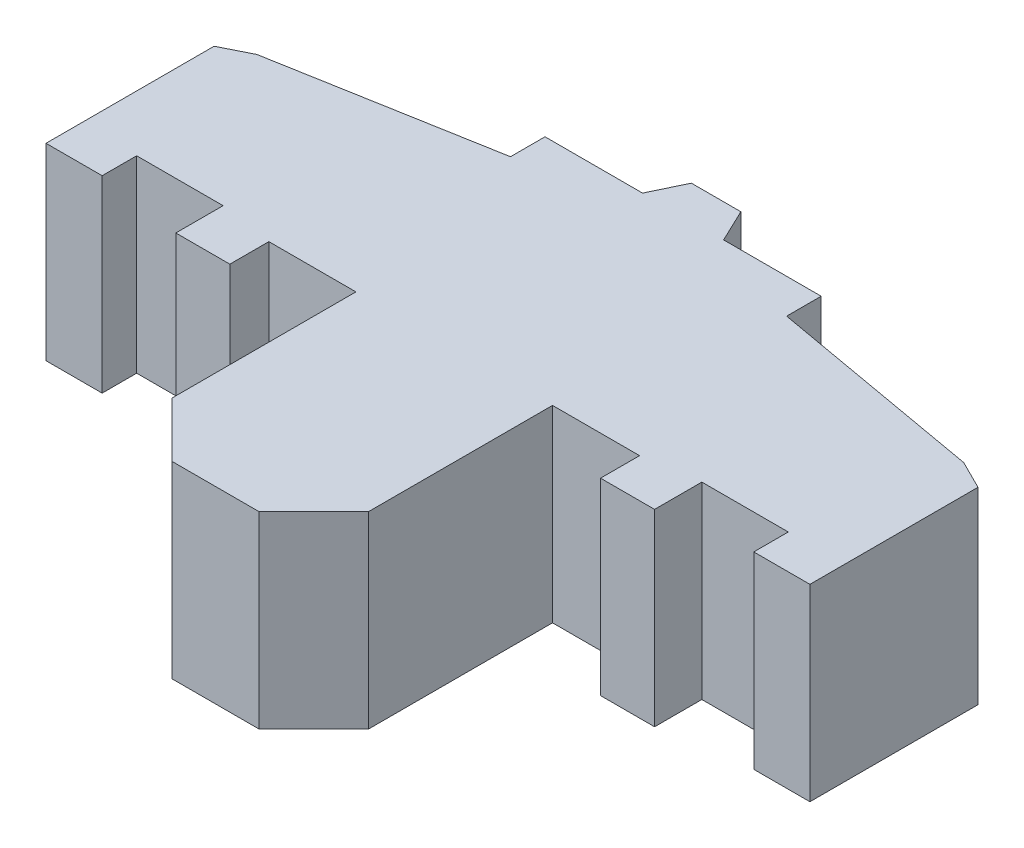
ISO-10303-21;
HEADER;
FILE_DESCRIPTION(('STEP AP214'),'2;1');
FILE_NAME('part.step','',(''),(''),'','','');
FILE_SCHEMA(('AUTOMOTIVE_DESIGN { 1 0 10303 214 1 1 1 1 }'));
ENDSEC;
DATA;
#1=APPLICATION_CONTEXT('core data for automotive mechanical design processes');
#2=APPLICATION_PROTOCOL_DEFINITION('international standard','automotive_design',2000,#1);
#3=PRODUCT_CONTEXT('',#1,'mechanical');
#4=PRODUCT('Part','Part','',(#3));
#5=PRODUCT_RELATED_PRODUCT_CATEGORY('part','',(#4));
#6=PRODUCT_DEFINITION_FORMATION('','',#4);
#7=PRODUCT_DEFINITION_CONTEXT('part definition',#1,'design');
#8=PRODUCT_DEFINITION('design','',#6,#7);
#9=PRODUCT_DEFINITION_SHAPE('','',#8);
#10=(LENGTH_UNIT() NAMED_UNIT(*) SI_UNIT(.MILLI.,.METRE.));
#11=(NAMED_UNIT(*) PLANE_ANGLE_UNIT() SI_UNIT($,.RADIAN.));
#12=(NAMED_UNIT(*) SI_UNIT($,.STERADIAN.) SOLID_ANGLE_UNIT());
#13=UNCERTAINTY_MEASURE_WITH_UNIT(LENGTH_MEASURE(1.E-05),#10,'distance_accuracy_value','');
#14=(GEOMETRIC_REPRESENTATION_CONTEXT(3) GLOBAL_UNCERTAINTY_ASSIGNED_CONTEXT((#13)) GLOBAL_UNIT_ASSIGNED_CONTEXT((#10,
#11,#12)) REPRESENTATION_CONTEXT('',''));
#15=CARTESIAN_POINT('',(0.,0.,0.));
#16=DIRECTION('',(0.,0.,1.));
#17=DIRECTION('',(1.,0.,0.));
#18=AXIS2_PLACEMENT_3D('',#15,#16,#17);
#19=CARTESIAN_POINT('',(5.3663365626813,23.,-43.1982400525542));
#20=DIRECTION('',(1.,0.,0.));
#21=DIRECTION('',(0.,0.,-1.));
#22=AXIS2_PLACEMENT_3D('',#19,#20,#21);
#23=PLANE('',#22);
#24=DIRECTION('',(0.,0.,1.));
#25=VECTOR('',#24,1.);
#26=CARTESIAN_POINT('',(5.3663365626813,0.,-43.1982400525542));
#27=LINE('',#26,#25);
#28=CARTESIAN_POINT('',(5.3663365626813,0.,-43.1982400525542));
#29=VERTEX_POINT('',#28);
#30=CARTESIAN_POINT('',(5.3663365626813,0.,-22.6685783082723));
#31=VERTEX_POINT('',#30);
#32=EDGE_CURVE('E273',#29,#31,#27,.T.);
#33=ORIENTED_EDGE('',*,*,#32,.T.);
#34=DIRECTION('',(0.,-1.,0.));
#35=VECTOR('',#34,1.);
#36=CARTESIAN_POINT('',(5.3663365626813,23.,-22.6685783082723));
#37=LINE('',#36,#35);
#38=CARTESIAN_POINT('',(5.3663365626813,23.,-22.6685783082723));
#39=VERTEX_POINT('',#38);
#40=EDGE_CURVE('E11',#39,#31,#37,.T.);
#41=ORIENTED_EDGE('',*,*,#40,.F.);
#42=DIRECTION('',(0.,0.,1.));
#43=VECTOR('',#42,1.);
#44=CARTESIAN_POINT('',(5.3663365626813,23.,-43.1982400525542));
#45=LINE('',#44,#43);
#46=CARTESIAN_POINT('',(5.3663365626813,23.,-43.1982400525542));
#47=VERTEX_POINT('',#46);
#48=EDGE_CURVE('E336',#47,#39,#45,.T.);
#49=ORIENTED_EDGE('',*,*,#48,.F.);
#50=DIRECTION('',(0.,-1.,0.));
#51=VECTOR('',#50,1.);
#52=CARTESIAN_POINT('',(5.3663365626813,23.,-43.1982400525542));
#53=LINE('',#52,#51);
#54=EDGE_CURVE('E269',#47,#29,#53,.T.);
#55=ORIENTED_EDGE('',*,*,#54,.T.);
#56=EDGE_LOOP('',(#33,#41,#49,#55));
#57=FACE_BOUND('',#56,.T.);
#58=ADVANCED_FACE('F33',(#57),#23,.F.);
#59=CARTESIAN_POINT('',(10.2238011718194,23.,-22.6685783082723));
#60=DIRECTION('',(0.,0.,-1.));
#61=DIRECTION('',(-1.,0.,0.));
#62=AXIS2_PLACEMENT_3D('',#59,#60,#61);
#63=PLANE('',#62);
#64=DIRECTION('',(1.,0.,0.));
#65=VECTOR('',#64,1.);
#66=CARTESIAN_POINT('',(10.2238011718194,0.,-22.6685783082723));
#67=LINE('',#66,#65);
#68=CARTESIAN_POINT('',(12.2238011718194,0.,-22.6685783082723));
#69=VERTEX_POINT('',#68);
#70=EDGE_CURVE('E276',#31,#69,#67,.T.);
#71=ORIENTED_EDGE('',*,*,#70,.T.);
#72=DIRECTION('',(0.,-1.,0.));
#73=VECTOR('',#72,1.);
#74=CARTESIAN_POINT('',(12.2238011718194,23.,-22.6685783082723));
#75=LINE('',#74,#73);
#76=CARTESIAN_POINT('',(12.2238011718194,23.,-22.6685783082723));
#77=VERTEX_POINT('',#76);
#78=EDGE_CURVE('E41',#77,#69,#75,.T.);
#79=ORIENTED_EDGE('',*,*,#78,.F.);
#80=DIRECTION('',(1.,0.,0.));
#81=VECTOR('',#80,1.);
#82=CARTESIAN_POINT('',(5.3663365626813,23.,-22.6685783082723));
#83=LINE('',#82,#81);
#84=EDGE_CURVE('E164',#39,#77,#83,.T.);
#85=ORIENTED_EDGE('',*,*,#84,.F.);
#86=ORIENTED_EDGE('',*,*,#40,.T.);
#87=EDGE_LOOP('',(#71,#79,#85,#86));
#88=FACE_BOUND('',#87,.T.);
#89=ADVANCED_FACE('F514',(#88),#63,.F.);
#90=CARTESIAN_POINT('',(12.2238011718194,23.,-22.6685783082723));
#91=DIRECTION('',(-1.,0.,0.));
#92=DIRECTION('',(0.,0.,1.));
#93=AXIS2_PLACEMENT_3D('',#90,#91,#92);
#94=PLANE('',#93);
#95=DIRECTION('',(0.,0.,-1.));
#96=VECTOR('',#95,1.);
#97=CARTESIAN_POINT('',(12.2238011718194,0.,-22.6685783082723));
#98=LINE('',#97,#96);
#99=CARTESIAN_POINT('',(12.2238011718194,0.,-26.8844909879017));
#100=VERTEX_POINT('',#99);
#101=EDGE_CURVE('E278',#69,#100,#98,.T.);
#102=ORIENTED_EDGE('',*,*,#101,.T.);
#103=DIRECTION('',(0.,-1.,0.));
#104=VECTOR('',#103,1.);
#105=CARTESIAN_POINT('',(12.2238011718194,23.,-26.8844909879017));
#106=LINE('',#105,#104);
#107=CARTESIAN_POINT('',(12.2238011718194,23.,-26.8844909879017));
#108=VERTEX_POINT('',#107);
#109=EDGE_CURVE('E415',#108,#100,#106,.T.);
#110=ORIENTED_EDGE('',*,*,#109,.F.);
#111=DIRECTION('',(0.,0.,-1.));
#112=VECTOR('',#111,1.);
#113=CARTESIAN_POINT('',(12.2238011718194,23.,-22.6685783082723));
#114=LINE('',#113,#112);
#115=EDGE_CURVE('E423',#77,#108,#114,.T.);
#116=ORIENTED_EDGE('',*,*,#115,.F.);
#117=ORIENTED_EDGE('',*,*,#78,.T.);
#118=EDGE_LOOP('',(#102,#110,#116,#117));
#119=FACE_BOUND('',#118,.T.);
#120=ADVANCED_FACE('F421',(#119),#94,.F.);
#121=CARTESIAN_POINT('',(12.2238011718194,23.,-26.8844909879017));
#122=DIRECTION('',(0.,0.,-1.));
#123=DIRECTION('',(-1.,0.,0.));
#124=AXIS2_PLACEMENT_3D('',#121,#122,#123);
#125=PLANE('',#124);
#126=DIRECTION('',(1.,0.,0.));
#127=VECTOR('',#126,1.);
#128=CARTESIAN_POINT('',(12.2238011718194,0.,-26.8844909879017));
#129=LINE('',#128,#127);
#130=CARTESIAN_POINT('',(22.7798889350632,0.,-26.8844909879017));
#131=VERTEX_POINT('',#130);
#132=EDGE_CURVE('E280',#100,#131,#129,.T.);
#133=ORIENTED_EDGE('',*,*,#132,.T.);
#134=DIRECTION('',(0.,-1.,0.));
#135=VECTOR('',#134,1.);
#136=CARTESIAN_POINT('',(22.7798889350632,23.,-26.8844909879017));
#137=LINE('',#136,#135);
#138=CARTESIAN_POINT('',(22.7798889350632,23.,-26.8844909879017));
#139=VERTEX_POINT('',#138);
#140=EDGE_CURVE('E412',#139,#131,#137,.T.);
#141=ORIENTED_EDGE('',*,*,#140,.F.);
#142=DIRECTION('',(1.,0.,0.));
#143=VECTOR('',#142,1.);
#144=CARTESIAN_POINT('',(12.2238011718194,23.,-26.8844909879017));
#145=LINE('',#144,#143);
#146=EDGE_CURVE('E441',#108,#139,#145,.T.);
#147=ORIENTED_EDGE('',*,*,#146,.F.);
#148=ORIENTED_EDGE('',*,*,#109,.T.);
#149=EDGE_LOOP('',(#133,#141,#147,#148));
#150=FACE_BOUND('',#149,.T.);
#151=ADVANCED_FACE('F432',(#150),#125,.F.);
#152=CARTESIAN_POINT('',(22.7798889350632,23.,-26.8844909879017));
#153=DIRECTION('',(1.,0.,0.));
#154=DIRECTION('',(0.,0.,-1.));
#155=AXIS2_PLACEMENT_3D('',#152,#153,#154);
#156=PLANE('',#155);
#157=DIRECTION('',(0.,0.,1.));
#158=VECTOR('',#157,1.);
#159=CARTESIAN_POINT('',(22.7798889350632,0.,-26.8844909879017));
#160=LINE('',#159,#158);
#161=CARTESIAN_POINT('',(22.7798889350632,0.,-21.1105236223224));
#162=VERTEX_POINT('',#161);
#163=EDGE_CURVE('E282',#131,#162,#160,.T.);
#164=ORIENTED_EDGE('',*,*,#163,.T.);
#165=DIRECTION('',(0.,-1.,0.));
#166=VECTOR('',#165,1.);
#167=CARTESIAN_POINT('',(22.7798889350632,23.,-21.1105236223224));
#168=LINE('',#167,#166);
#169=CARTESIAN_POINT('',(22.7798889350632,23.,-21.1105236223224));
#170=VERTEX_POINT('',#169);
#171=EDGE_CURVE('E409',#170,#162,#168,.T.);
#172=ORIENTED_EDGE('',*,*,#171,.F.);
#173=DIRECTION('',(0.,0.,1.));
#174=VECTOR('',#173,1.);
#175=CARTESIAN_POINT('',(22.7798889350632,23.,-26.8844909879017));
#176=LINE('',#175,#174);
#177=EDGE_CURVE('E438',#139,#170,#176,.T.);
#178=ORIENTED_EDGE('',*,*,#177,.F.);
#179=ORIENTED_EDGE('',*,*,#140,.T.);
#180=EDGE_LOOP('',(#164,#172,#178,#179));
#181=FACE_BOUND('',#180,.T.);
#182=ADVANCED_FACE('F436',(#181),#156,.F.);
#183=CARTESIAN_POINT('',(22.7798889350632,23.,-21.1105236223224));
#184=DIRECTION('',(0.,0.,-1.));
#185=DIRECTION('',(-1.,0.,0.));
#186=AXIS2_PLACEMENT_3D('',#183,#184,#185);
#187=PLANE('',#186);
#188=DIRECTION('',(1.,0.,0.));
#189=VECTOR('',#188,1.);
#190=CARTESIAN_POINT('',(22.7798889350632,0.,-21.1105236223224));
#191=LINE('',#190,#189);
#192=CARTESIAN_POINT('',(29.3787087814395,0.,-21.1105236223224));
#193=VERTEX_POINT('',#192);
#194=EDGE_CURVE('E284',#162,#193,#191,.T.);
#195=ORIENTED_EDGE('',*,*,#194,.T.);
#196=DIRECTION('',(0.,-1.,0.));
#197=VECTOR('',#196,1.);
#198=CARTESIAN_POINT('',(29.3787087814395,23.,-21.1105236223224));
#199=LINE('',#198,#197);
#200=CARTESIAN_POINT('',(29.3787087814395,23.,-21.1105236223224));
#201=VERTEX_POINT('',#200);
#202=EDGE_CURVE('E406',#201,#193,#199,.T.);
#203=ORIENTED_EDGE('',*,*,#202,.F.);
#204=DIRECTION('',(1.,0.,0.));
#205=VECTOR('',#204,1.);
#206=CARTESIAN_POINT('',(22.7798889350632,23.,-21.1105236223224));
#207=LINE('',#206,#205);
#208=EDGE_CURVE('E440',#170,#201,#207,.T.);
#209=ORIENTED_EDGE('',*,*,#208,.F.);
#210=ORIENTED_EDGE('',*,*,#171,.T.);
#211=EDGE_LOOP('',(#195,#203,#209,#210));
#212=FACE_BOUND('',#211,.T.);
#213=ADVANCED_FACE('F527',(#212),#187,.F.);
#214=CARTESIAN_POINT('',(29.3787087814395,23.,-21.1105236223224));
#215=DIRECTION('',(-1.,0.,0.));
#216=DIRECTION('',(0.,0.,1.));
#217=AXIS2_PLACEMENT_3D('',#214,#215,#216);
#218=PLANE('',#217);
#219=DIRECTION('',(0.,0.,-1.));
#220=VECTOR('',#219,1.);
#221=CARTESIAN_POINT('',(29.3787087814395,0.,-21.1105236223224));
#222=LINE('',#221,#220);
#223=CARTESIAN_POINT('',(29.3787087814395,0.,-25.8763379558164));
#224=VERTEX_POINT('',#223);
#225=EDGE_CURVE('E286',#193,#224,#222,.T.);
#226=ORIENTED_EDGE('',*,*,#225,.T.);
#227=DIRECTION('',(0.,-1.,0.));
#228=VECTOR('',#227,1.);
#229=CARTESIAN_POINT('',(29.3787087814395,23.,-25.8763379558164));
#230=LINE('',#229,#228);
#231=CARTESIAN_POINT('',(29.3787087814395,23.,-25.8763379558164));
#232=VERTEX_POINT('',#231);
#233=EDGE_CURVE('E403',#232,#224,#230,.T.);
#234=ORIENTED_EDGE('',*,*,#233,.F.);
#235=DIRECTION('',(0.,0.,-1.));
#236=VECTOR('',#235,1.);
#237=CARTESIAN_POINT('',(29.3787087814395,23.,-21.1105236223224));
#238=LINE('',#237,#236);
#239=EDGE_CURVE('E443',#201,#232,#238,.T.);
#240=ORIENTED_EDGE('',*,*,#239,.F.);
#241=ORIENTED_EDGE('',*,*,#202,.T.);
#242=EDGE_LOOP('',(#226,#234,#240,#241));
#243=FACE_BOUND('',#242,.T.);
#244=ADVANCED_FACE('F530',(#243),#218,.F.);
#245=CARTESIAN_POINT('',(29.3787087814395,23.,-25.8763379558164));
#246=DIRECTION('',(0.,0.,-1.));
#247=DIRECTION('',(-1.,0.,0.));
#248=AXIS2_PLACEMENT_3D('',#245,#246,#247);
#249=PLANE('',#248);
#250=DIRECTION('',(1.,0.,0.));
#251=VECTOR('',#250,1.);
#252=CARTESIAN_POINT('',(29.3787087814395,0.,-25.8763379558164));
#253=LINE('',#252,#251);
#254=CARTESIAN_POINT('',(40.0101407561569,0.,-25.8763379558164));
#255=VERTEX_POINT('',#254);
#256=EDGE_CURVE('E288',#224,#255,#253,.T.);
#257=ORIENTED_EDGE('',*,*,#256,.T.);
#258=DIRECTION('',(0.,-1.,0.));
#259=VECTOR('',#258,1.);
#260=CARTESIAN_POINT('',(40.0101407561569,23.,-25.8763379558164));
#261=LINE('',#260,#259);
#262=CARTESIAN_POINT('',(40.0101407561569,23.,-25.8763379558164));
#263=VERTEX_POINT('',#262);
#264=EDGE_CURVE('E400',#263,#255,#261,.T.);
#265=ORIENTED_EDGE('',*,*,#264,.F.);
#266=DIRECTION('',(1.,0.,0.));
#267=VECTOR('',#266,1.);
#268=CARTESIAN_POINT('',(29.3787087814395,23.,-25.8763379558164));
#269=LINE('',#268,#267);
#270=EDGE_CURVE('E449',#232,#263,#269,.T.);
#271=ORIENTED_EDGE('',*,*,#270,.F.);
#272=ORIENTED_EDGE('',*,*,#233,.T.);
#273=EDGE_LOOP('',(#257,#265,#271,#272));
#274=FACE_BOUND('',#273,.T.);
#275=ADVANCED_FACE('F534',(#274),#249,.F.);
#276=CARTESIAN_POINT('',(40.0101407561569,23.,-25.8763379558164));
#277=DIRECTION('',(1.,0.,0.));
#278=DIRECTION('',(0.,0.,-1.));
#279=AXIS2_PLACEMENT_3D('',#276,#277,#278);
#280=PLANE('',#279);
#281=DIRECTION('',(0.,0.,1.));
#282=VECTOR('',#281,1.);
#283=CARTESIAN_POINT('',(40.0101407561569,0.,-25.8763379558164));
#284=LINE('',#283,#282);
#285=CARTESIAN_POINT('',(40.0101407561569,0.,-3.42202042300811));
#286=VERTEX_POINT('',#285);
#287=EDGE_CURVE('E290',#255,#286,#284,.T.);
#288=ORIENTED_EDGE('',*,*,#287,.T.);
#289=DIRECTION('',(0.,-1.,0.));
#290=VECTOR('',#289,1.);
#291=CARTESIAN_POINT('',(40.0101407561569,23.,-3.42202042300811));
#292=LINE('',#291,#290);
#293=CARTESIAN_POINT('',(40.0101407561569,23.,-3.42202042300811));
#294=VERTEX_POINT('',#293);
#295=EDGE_CURVE('E397',#294,#286,#292,.T.);
#296=ORIENTED_EDGE('',*,*,#295,.F.);
#297=DIRECTION('',(0.,0.,1.));
#298=VECTOR('',#297,1.);
#299=CARTESIAN_POINT('',(40.0101407561569,23.,-25.8763379558164));
#300=LINE('',#299,#298);
#301=EDGE_CURVE('E451',#263,#294,#300,.T.);
#302=ORIENTED_EDGE('',*,*,#301,.F.);
#303=ORIENTED_EDGE('',*,*,#264,.T.);
#304=EDGE_LOOP('',(#288,#296,#302,#303));
#305=FACE_BOUND('',#304,.T.);
#306=ADVANCED_FACE('F538',(#305),#280,.F.);
#307=CARTESIAN_POINT('',(40.0101407561569,23.,-3.42202042300811));
#308=DIRECTION('',(0.707106781186536,0.,-0.707106781186559));
#309=DIRECTION('',(-0.707106781186559,0.,-0.707106781186536));
#310=AXIS2_PLACEMENT_3D('',#307,#308,#309);
#311=PLANE('',#310);
#312=DIRECTION('',(0.707106781186559,0.,0.707106781186536));
#313=VECTOR('',#312,1.);
#314=CARTESIAN_POINT('',(40.0101407561569,0.,-3.42202042300811));
#315=LINE('',#314,#313);
#316=CARTESIAN_POINT('',(46.7143171710472,0.,3.28215599188192));
#317=VERTEX_POINT('',#316);
#318=EDGE_CURVE('E292',#286,#317,#315,.T.);
#319=ORIENTED_EDGE('',*,*,#318,.T.);
#320=DIRECTION('',(0.,-1.,0.));
#321=VECTOR('',#320,1.);
#322=CARTESIAN_POINT('',(46.7143171710472,23.,3.28215599188192));
#323=LINE('',#322,#321);
#324=CARTESIAN_POINT('',(46.7143171710472,23.,3.28215599188192));
#325=VERTEX_POINT('',#324);
#326=EDGE_CURVE('E394',#325,#317,#323,.T.);
#327=ORIENTED_EDGE('',*,*,#326,.F.);
#328=DIRECTION('',(0.707106781186559,0.,0.707106781186536));
#329=VECTOR('',#328,1.);
#330=CARTESIAN_POINT('',(40.0101407561569,23.,-3.42202042300811));
#331=LINE('',#330,#329);
#332=EDGE_CURVE('E453',#294,#325,#331,.T.);
#333=ORIENTED_EDGE('',*,*,#332,.F.);
#334=ORIENTED_EDGE('',*,*,#295,.T.);
#335=EDGE_LOOP('',(#319,#327,#333,#334));
#336=FACE_BOUND('',#335,.T.);
#337=ADVANCED_FACE('F542',(#336),#311,.F.);
#338=CARTESIAN_POINT('',(46.7143171710472,23.,3.28215599188192));
#339=DIRECTION('',(0.,0.,-1.));
#340=DIRECTION('',(-1.,0.,0.));
#341=AXIS2_PLACEMENT_3D('',#338,#339,#340);
#342=PLANE('',#341);
#343=DIRECTION('',(1.,0.,0.));
#344=VECTOR('',#343,1.);
#345=CARTESIAN_POINT('',(46.7143171710472,0.,3.28215599188192));
#346=LINE('',#345,#344);
#347=CARTESIAN_POINT('',(57.3183365600249,0.,3.28215599188192));
#348=VERTEX_POINT('',#347);
#349=EDGE_CURVE('E294',#317,#348,#346,.T.);
#350=ORIENTED_EDGE('',*,*,#349,.T.);
#351=DIRECTION('',(0.,-1.,0.));
#352=VECTOR('',#351,1.);
#353=CARTESIAN_POINT('',(57.3183365600249,23.,3.28215599188192));
#354=LINE('',#353,#352);
#355=CARTESIAN_POINT('',(57.3183365600249,23.,3.28215599188192));
#356=VERTEX_POINT('',#355);
#357=EDGE_CURVE('E391',#356,#348,#354,.T.);
#358=ORIENTED_EDGE('',*,*,#357,.F.);
#359=DIRECTION('',(1.,0.,0.));
#360=VECTOR('',#359,1.);
#361=CARTESIAN_POINT('',(46.7143171710472,23.,3.28215599188192));
#362=LINE('',#361,#360);
#363=EDGE_CURVE('E455',#325,#356,#362,.T.);
#364=ORIENTED_EDGE('',*,*,#363,.F.);
#365=ORIENTED_EDGE('',*,*,#326,.T.);
#366=EDGE_LOOP('',(#350,#358,#364,#365));
#367=FACE_BOUND('',#366,.T.);
#368=ADVANCED_FACE('F546',(#367),#342,.F.);
#369=CARTESIAN_POINT('',(64.0225129749152,23.,-3.42202042300811));
#370=DIRECTION('',(-0.707106781186536,0.,-0.707106781186559));
#371=DIRECTION('',(-0.707106781186559,0.,0.707106781186536));
#372=AXIS2_PLACEMENT_3D('',#369,#370,#371);
#373=PLANE('',#372);
#374=DIRECTION('',(0.707106781186559,0.,-0.707106781186536));
#375=VECTOR('',#374,1.);
#376=CARTESIAN_POINT('',(64.0225129749152,0.,-3.42202042300811));
#377=LINE('',#376,#375);
#378=CARTESIAN_POINT('',(64.0225129749152,0.,-3.42202042300811));
#379=VERTEX_POINT('',#378);
#380=EDGE_CURVE('E296',#348,#379,#377,.T.);
#381=ORIENTED_EDGE('',*,*,#380,.T.);
#382=DIRECTION('',(0.,-1.,0.));
#383=VECTOR('',#382,1.);
#384=CARTESIAN_POINT('',(64.0225129749152,23.,-3.42202042300811));
#385=LINE('',#384,#383);
#386=CARTESIAN_POINT('',(64.0225129749152,23.,-3.42202042300811));
#387=VERTEX_POINT('',#386);
#388=EDGE_CURVE('E388',#387,#379,#385,.T.);
#389=ORIENTED_EDGE('',*,*,#388,.F.);
#390=DIRECTION('',(0.707106781186559,0.,-0.707106781186536));
#391=VECTOR('',#390,1.);
#392=CARTESIAN_POINT('',(64.0225129749152,23.,-3.42202042300811));
#393=LINE('',#392,#391);
#394=EDGE_CURVE('E457',#356,#387,#393,.T.);
#395=ORIENTED_EDGE('',*,*,#394,.F.);
#396=ORIENTED_EDGE('',*,*,#357,.T.);
#397=EDGE_LOOP('',(#381,#389,#395,#396));
#398=FACE_BOUND('',#397,.T.);
#399=ADVANCED_FACE('F550',(#398),#373,.F.);
#400=CARTESIAN_POINT('',(64.0225129749152,23.,-25.8763379558164));
#401=DIRECTION('',(-1.,0.,0.));
#402=DIRECTION('',(0.,0.,1.));
#403=AXIS2_PLACEMENT_3D('',#400,#401,#402);
#404=PLANE('',#403);
#405=DIRECTION('',(0.,0.,-1.));
#406=VECTOR('',#405,1.);
#407=CARTESIAN_POINT('',(64.0225129749152,0.,-25.8763379558164));
#408=LINE('',#407,#406);
#409=CARTESIAN_POINT('',(64.0225129749152,0.,-25.8763379558164));
#410=VERTEX_POINT('',#409);
#411=EDGE_CURVE('E298',#379,#410,#408,.T.);
#412=ORIENTED_EDGE('',*,*,#411,.T.);
#413=DIRECTION('',(0.,-1.,0.));
#414=VECTOR('',#413,1.);
#415=CARTESIAN_POINT('',(64.0225129749152,23.,-25.8763379558164));
#416=LINE('',#415,#414);
#417=CARTESIAN_POINT('',(64.0225129749152,23.,-25.8763379558164));
#418=VERTEX_POINT('',#417);
#419=EDGE_CURVE('E385',#418,#410,#416,.T.);
#420=ORIENTED_EDGE('',*,*,#419,.F.);
#421=DIRECTION('',(0.,0.,-1.));
#422=VECTOR('',#421,1.);
#423=CARTESIAN_POINT('',(64.0225129749152,23.,-25.8763379558164));
#424=LINE('',#423,#422);
#425=EDGE_CURVE('E459',#387,#418,#424,.T.);
#426=ORIENTED_EDGE('',*,*,#425,.F.);
#427=ORIENTED_EDGE('',*,*,#388,.T.);
#428=EDGE_LOOP('',(#412,#420,#426,#427));
#429=FACE_BOUND('',#428,.T.);
#430=ADVANCED_FACE('F554',(#429),#404,.F.);
#431=CARTESIAN_POINT('',(74.6539449496325,23.,-25.8763379558164));
#432=DIRECTION('',(0.,0.,-1.));
#433=DIRECTION('',(-1.,0.,0.));
#434=AXIS2_PLACEMENT_3D('',#431,#432,#433);
#435=PLANE('',#434);
#436=DIRECTION('',(1.,0.,0.));
#437=VECTOR('',#436,1.);
#438=CARTESIAN_POINT('',(74.6539449496325,0.,-25.8763379558164));
#439=LINE('',#438,#437);
#440=CARTESIAN_POINT('',(74.6539449496325,0.,-25.8763379558164));
#441=VERTEX_POINT('',#440);
#442=EDGE_CURVE('E300',#410,#441,#439,.T.);
#443=ORIENTED_EDGE('',*,*,#442,.T.);
#444=DIRECTION('',(0.,-1.,0.));
#445=VECTOR('',#444,1.);
#446=CARTESIAN_POINT('',(74.6539449496325,23.,-25.8763379558164));
#447=LINE('',#446,#445);
#448=CARTESIAN_POINT('',(74.6539449496325,23.,-25.8763379558164));
#449=VERTEX_POINT('',#448);
#450=EDGE_CURVE('E382',#449,#441,#447,.T.);
#451=ORIENTED_EDGE('',*,*,#450,.F.);
#452=DIRECTION('',(1.,0.,0.));
#453=VECTOR('',#452,1.);
#454=CARTESIAN_POINT('',(74.6539449496325,23.,-25.8763379558164));
#455=LINE('',#454,#453);
#456=EDGE_CURVE('E461',#418,#449,#455,.T.);
#457=ORIENTED_EDGE('',*,*,#456,.F.);
#458=ORIENTED_EDGE('',*,*,#419,.T.);
#459=EDGE_LOOP('',(#443,#451,#457,#458));
#460=FACE_BOUND('',#459,.T.);
#461=ADVANCED_FACE('F558',(#460),#435,.F.);
#462=CARTESIAN_POINT('',(74.6539449496325,23.,-21.1105236223224));
#463=DIRECTION('',(1.,0.,0.));
#464=DIRECTION('',(0.,0.,-1.));
#465=AXIS2_PLACEMENT_3D('',#462,#463,#464);
#466=PLANE('',#465);
#467=DIRECTION('',(0.,0.,1.));
#468=VECTOR('',#467,1.);
#469=CARTESIAN_POINT('',(74.6539449496325,0.,-21.1105236223224));
#470=LINE('',#469,#468);
#471=CARTESIAN_POINT('',(74.6539449496325,0.,-21.1105236223224));
#472=VERTEX_POINT('',#471);
#473=EDGE_CURVE('E302',#441,#472,#470,.T.);
#474=ORIENTED_EDGE('',*,*,#473,.T.);
#475=DIRECTION('',(0.,-1.,0.));
#476=VECTOR('',#475,1.);
#477=CARTESIAN_POINT('',(74.6539449496325,23.,-21.1105236223224));
#478=LINE('',#477,#476);
#479=CARTESIAN_POINT('',(74.6539449496325,23.,-21.1105236223224));
#480=VERTEX_POINT('',#479);
#481=EDGE_CURVE('E379',#480,#472,#478,.T.);
#482=ORIENTED_EDGE('',*,*,#481,.F.);
#483=DIRECTION('',(0.,0.,1.));
#484=VECTOR('',#483,1.);
#485=CARTESIAN_POINT('',(74.6539449496325,23.,-21.1105236223224));
#486=LINE('',#485,#484);
#487=EDGE_CURVE('E463',#449,#480,#486,.T.);
#488=ORIENTED_EDGE('',*,*,#487,.F.);
#489=ORIENTED_EDGE('',*,*,#450,.T.);
#490=EDGE_LOOP('',(#474,#482,#488,#489));
#491=FACE_BOUND('',#490,.T.);
#492=ADVANCED_FACE('F562',(#491),#466,.F.);
#493=CARTESIAN_POINT('',(81.2527647960088,23.,-21.1105236223224));
#494=DIRECTION('',(0.,0.,-1.));
#495=DIRECTION('',(-1.,0.,0.));
#496=AXIS2_PLACEMENT_3D('',#493,#494,#495);
#497=PLANE('',#496);
#498=DIRECTION('',(1.,0.,0.));
#499=VECTOR('',#498,1.);
#500=CARTESIAN_POINT('',(81.2527647960088,0.,-21.1105236223224));
#501=LINE('',#500,#499);
#502=CARTESIAN_POINT('',(81.2527647960088,0.,-21.1105236223224));
#503=VERTEX_POINT('',#502);
#504=EDGE_CURVE('E304',#472,#503,#501,.T.);
#505=ORIENTED_EDGE('',*,*,#504,.T.);
#506=DIRECTION('',(0.,-1.,0.));
#507=VECTOR('',#506,1.);
#508=CARTESIAN_POINT('',(81.2527647960088,23.,-21.1105236223224));
#509=LINE('',#508,#507);
#510=CARTESIAN_POINT('',(81.2527647960088,23.,-21.1105236223224));
#511=VERTEX_POINT('',#510);
#512=EDGE_CURVE('E376',#511,#503,#509,.T.);
#513=ORIENTED_EDGE('',*,*,#512,.F.);
#514=DIRECTION('',(1.,0.,0.));
#515=VECTOR('',#514,1.);
#516=CARTESIAN_POINT('',(81.2527647960088,23.,-21.1105236223224));
#517=LINE('',#516,#515);
#518=EDGE_CURVE('E465',#480,#511,#517,.T.);
#519=ORIENTED_EDGE('',*,*,#518,.F.);
#520=ORIENTED_EDGE('',*,*,#481,.T.);
#521=EDGE_LOOP('',(#505,#513,#519,#520));
#522=FACE_BOUND('',#521,.T.);
#523=ADVANCED_FACE('F566',(#522),#497,.F.);
#524=CARTESIAN_POINT('',(81.2527647960088,23.,-26.8844909879017));
#525=DIRECTION('',(-1.,0.,0.));
#526=DIRECTION('',(0.,0.,1.));
#527=AXIS2_PLACEMENT_3D('',#524,#525,#526);
#528=PLANE('',#527);
#529=DIRECTION('',(0.,0.,-1.));
#530=VECTOR('',#529,1.);
#531=CARTESIAN_POINT('',(81.2527647960088,0.,-26.8844909879017));
#532=LINE('',#531,#530);
#533=CARTESIAN_POINT('',(81.2527647960088,0.,-26.8844909879017));
#534=VERTEX_POINT('',#533);
#535=EDGE_CURVE('E306',#503,#534,#532,.T.);
#536=ORIENTED_EDGE('',*,*,#535,.T.);
#537=DIRECTION('',(0.,-1.,0.));
#538=VECTOR('',#537,1.);
#539=CARTESIAN_POINT('',(81.2527647960088,23.,-26.8844909879017));
#540=LINE('',#539,#538);
#541=CARTESIAN_POINT('',(81.2527647960088,23.,-26.8844909879017));
#542=VERTEX_POINT('',#541);
#543=EDGE_CURVE('E373',#542,#534,#540,.T.);
#544=ORIENTED_EDGE('',*,*,#543,.F.);
#545=DIRECTION('',(0.,0.,-1.));
#546=VECTOR('',#545,1.);
#547=CARTESIAN_POINT('',(81.2527647960088,23.,-26.8844909879017));
#548=LINE('',#547,#546);
#549=EDGE_CURVE('E467',#511,#542,#548,.T.);
#550=ORIENTED_EDGE('',*,*,#549,.F.);
#551=ORIENTED_EDGE('',*,*,#512,.T.);
#552=EDGE_LOOP('',(#536,#544,#550,#551));
#553=FACE_BOUND('',#552,.T.);
#554=ADVANCED_FACE('F570',(#553),#528,.F.);
#555=CARTESIAN_POINT('',(91.8088525592527,23.,-26.8844909879017));
#556=DIRECTION('',(0.,0.,-1.));
#557=DIRECTION('',(-1.,0.,0.));
#558=AXIS2_PLACEMENT_3D('',#555,#556,#557);
#559=PLANE('',#558);
#560=DIRECTION('',(1.,0.,0.));
#561=VECTOR('',#560,1.);
#562=CARTESIAN_POINT('',(91.8088525592527,0.,-26.8844909879017));
#563=LINE('',#562,#561);
#564=CARTESIAN_POINT('',(91.8088525592527,0.,-26.8844909879017));
#565=VERTEX_POINT('',#564);
#566=EDGE_CURVE('E308',#534,#565,#563,.T.);
#567=ORIENTED_EDGE('',*,*,#566,.T.);
#568=DIRECTION('',(0.,-1.,0.));
#569=VECTOR('',#568,1.);
#570=CARTESIAN_POINT('',(91.8088525592527,23.,-26.8844909879017));
#571=LINE('',#570,#569);
#572=CARTESIAN_POINT('',(91.8088525592527,23.,-26.8844909879017));
#573=VERTEX_POINT('',#572);
#574=EDGE_CURVE('E370',#573,#565,#571,.T.);
#575=ORIENTED_EDGE('',*,*,#574,.F.);
#576=DIRECTION('',(1.,0.,0.));
#577=VECTOR('',#576,1.);
#578=CARTESIAN_POINT('',(91.8088525592527,23.,-26.8844909879017));
#579=LINE('',#578,#577);
#580=EDGE_CURVE('E469',#542,#573,#579,.T.);
#581=ORIENTED_EDGE('',*,*,#580,.F.);
#582=ORIENTED_EDGE('',*,*,#543,.T.);
#583=EDGE_LOOP('',(#567,#575,#581,#582));
#584=FACE_BOUND('',#583,.T.);
#585=ADVANCED_FACE('F574',(#584),#559,.F.);
#586=CARTESIAN_POINT('',(91.8088525592527,23.,-22.6685783082723));
#587=DIRECTION('',(1.,0.,0.));
#588=DIRECTION('',(0.,0.,-1.));
#589=AXIS2_PLACEMENT_3D('',#586,#587,#588);
#590=PLANE('',#589);
#591=DIRECTION('',(0.,0.,1.));
#592=VECTOR('',#591,1.);
#593=CARTESIAN_POINT('',(91.8088525592527,0.,-22.6685783082723));
#594=LINE('',#593,#592);
#595=CARTESIAN_POINT('',(91.8088525592527,0.,-22.6685783082723));
#596=VERTEX_POINT('',#595);
#597=EDGE_CURVE('E310',#565,#596,#594,.T.);
#598=ORIENTED_EDGE('',*,*,#597,.T.);
#599=DIRECTION('',(0.,-1.,0.));
#600=VECTOR('',#599,1.);
#601=CARTESIAN_POINT('',(91.8088525592527,23.,-22.6685783082723));
#602=LINE('',#601,#600);
#603=CARTESIAN_POINT('',(91.8088525592527,23.,-22.6685783082723));
#604=VERTEX_POINT('',#603);
#605=EDGE_CURVE('E367',#604,#596,#602,.T.);
#606=ORIENTED_EDGE('',*,*,#605,.F.);
#607=DIRECTION('',(0.,0.,1.));
#608=VECTOR('',#607,1.);
#609=CARTESIAN_POINT('',(91.8088525592527,23.,-22.6685783082723));
#610=LINE('',#609,#608);
#611=EDGE_CURVE('E471',#573,#604,#610,.T.);
#612=ORIENTED_EDGE('',*,*,#611,.F.);
#613=ORIENTED_EDGE('',*,*,#574,.T.);
#614=EDGE_LOOP('',(#598,#606,#612,#613));
#615=FACE_BOUND('',#614,.T.);
#616=ADVANCED_FACE('F578',(#615),#590,.F.);
#617=CARTESIAN_POINT('',(98.6663171683908,23.,-22.6685783082723));
#618=DIRECTION('',(0.,0.,-1.));
#619=DIRECTION('',(-1.,0.,0.));
#620=AXIS2_PLACEMENT_3D('',#617,#618,#619);
#621=PLANE('',#620);
#622=DIRECTION('',(1.,0.,0.));
#623=VECTOR('',#622,1.);
#624=CARTESIAN_POINT('',(98.6663171683908,0.,-22.6685783082723));
#625=LINE('',#624,#623);
#626=CARTESIAN_POINT('',(98.6663171683908,0.,-22.6685783082723));
#627=VERTEX_POINT('',#626);
#628=EDGE_CURVE('E313',#596,#627,#625,.T.);
#629=ORIENTED_EDGE('',*,*,#628,.T.);
#630=DIRECTION('',(0.,-1.,0.));
#631=VECTOR('',#630,1.);
#632=CARTESIAN_POINT('',(98.6663171683908,23.,-22.6685783082723));
#633=LINE('',#632,#631);
#634=CARTESIAN_POINT('',(98.6663171683908,23.,-22.6685783082723));
#635=VERTEX_POINT('',#634);
#636=EDGE_CURVE('E364',#635,#627,#633,.T.);
#637=ORIENTED_EDGE('',*,*,#636,.F.);
#638=DIRECTION('',(1.,0.,0.));
#639=VECTOR('',#638,1.);
#640=CARTESIAN_POINT('',(93.8088525592527,23.,-22.6685783082723));
#641=LINE('',#640,#639);
#642=EDGE_CURVE('E473',#604,#635,#641,.T.);
#643=ORIENTED_EDGE('',*,*,#642,.F.);
#644=ORIENTED_EDGE('',*,*,#605,.T.);
#645=EDGE_LOOP('',(#629,#637,#643,#644));
#646=FACE_BOUND('',#645,.T.);
#647=ADVANCED_FACE('F582',(#646),#621,.F.);
#648=CARTESIAN_POINT('',(98.6663171683908,23.,-43.1982400525542));
#649=DIRECTION('',(-1.,0.,0.));
#650=DIRECTION('',(0.,0.,1.));
#651=AXIS2_PLACEMENT_3D('',#648,#649,#650);
#652=PLANE('',#651);
#653=DIRECTION('',(0.,0.,-1.));
#654=VECTOR('',#653,1.);
#655=CARTESIAN_POINT('',(98.6663171683908,0.,-43.1982400525542));
#656=LINE('',#655,#654);
#657=CARTESIAN_POINT('',(98.6663171683908,0.,-43.1982400525542));
#658=VERTEX_POINT('',#657);
#659=EDGE_CURVE('E315',#627,#658,#656,.T.);
#660=ORIENTED_EDGE('',*,*,#659,.T.);
#661=DIRECTION('',(0.,-1.,0.));
#662=VECTOR('',#661,1.);
#663=CARTESIAN_POINT('',(98.6663171683908,23.,-43.1982400525542));
#664=LINE('',#663,#662);
#665=CARTESIAN_POINT('',(98.6663171683908,23.,-43.1982400525542));
#666=VERTEX_POINT('',#665);
#667=EDGE_CURVE('E361',#666,#658,#664,.T.);
#668=ORIENTED_EDGE('',*,*,#667,.F.);
#669=DIRECTION('',(0.,0.,-1.));
#670=VECTOR('',#669,1.);
#671=CARTESIAN_POINT('',(98.6663171683908,23.,-43.1982400525542));
#672=LINE('',#671,#670);
#673=EDGE_CURVE('E475',#635,#666,#672,.T.);
#674=ORIENTED_EDGE('',*,*,#673,.F.);
#675=ORIENTED_EDGE('',*,*,#636,.T.);
#676=EDGE_LOOP('',(#660,#668,#674,#675));
#677=FACE_BOUND('',#676,.T.);
#678=ADVANCED_FACE('F586',(#677),#652,.F.);
#679=CARTESIAN_POINT('',(98.6663171683908,23.,-43.1982400525542));
#680=DIRECTION('',(-0.447213595499958,0.,0.894427190999916));
#681=DIRECTION('',(0.894427190999916,0.,0.447213595499958));
#682=AXIS2_PLACEMENT_3D('',#679,#680,#681);
#683=PLANE('',#682);
#684=DIRECTION('',(-0.894427190999916,0.,-0.447213595499958));
#685=VECTOR('',#684,1.);
#686=CARTESIAN_POINT('',(98.6663171683908,0.,-43.1982400525542));
#687=LINE('',#686,#685);
#688=CARTESIAN_POINT('',(95.1836066939144,0.,-44.9395952897924));
#689=VERTEX_POINT('',#688);
#690=EDGE_CURVE('E317',#658,#689,#687,.T.);
#691=ORIENTED_EDGE('',*,*,#690,.T.);
#692=DIRECTION('',(0.,-1.,0.));
#693=VECTOR('',#692,1.);
#694=CARTESIAN_POINT('',(95.1836066939144,23.,-44.9395952897924));
#695=LINE('',#694,#693);
#696=CARTESIAN_POINT('',(95.1836066939144,23.,-44.9395952897924));
#697=VERTEX_POINT('',#696);
#698=EDGE_CURVE('E358',#697,#689,#695,.T.);
#699=ORIENTED_EDGE('',*,*,#698,.F.);
#700=DIRECTION('',(-0.894427190999916,0.,-0.447213595499958));
#701=VECTOR('',#700,1.);
#702=CARTESIAN_POINT('',(98.6663171683908,23.,-43.1982400525542));
#703=LINE('',#702,#701);
#704=EDGE_CURVE('E477',#666,#697,#703,.T.);
#705=ORIENTED_EDGE('',*,*,#704,.F.);
#706=ORIENTED_EDGE('',*,*,#667,.T.);
#707=EDGE_LOOP('',(#691,#699,#705,#706));
#708=FACE_BOUND('',#707,.T.);
#709=ADVANCED_FACE('F590',(#708),#683,.F.);
#710=CARTESIAN_POINT('',(95.1836066939144,23.,-44.9395952897924));
#711=DIRECTION('',(-0.174959434764492,0.,0.984575642694298));
#712=DIRECTION('',(0.984575642694298,0.,0.174959434764492));
#713=AXIS2_PLACEMENT_3D('',#710,#711,#712);
#714=PLANE('',#713);
#715=DIRECTION('',(-0.984575642694298,0.,-0.174959434764492));
#716=VECTOR('',#715,1.);
#717=CARTESIAN_POINT('',(95.1836066939144,0.,-44.9395952897924));
#718=LINE('',#717,#716);
#719=CARTESIAN_POINT('',(68.8799775840533,0.,-49.6137593476423));
#720=VERTEX_POINT('',#719);
#721=EDGE_CURVE('E319',#689,#720,#718,.T.);
#722=ORIENTED_EDGE('',*,*,#721,.T.);
#723=DIRECTION('',(0.,-1.,0.));
#724=VECTOR('',#723,1.);
#725=CARTESIAN_POINT('',(68.8799775840533,23.,-49.6137593476423));
#726=LINE('',#725,#724);
#727=CARTESIAN_POINT('',(68.8799775840533,23.,-49.6137593476423));
#728=VERTEX_POINT('',#727);
#729=EDGE_CURVE('E355',#728,#720,#726,.T.);
#730=ORIENTED_EDGE('',*,*,#729,.F.);
#731=DIRECTION('',(-0.984575642694298,0.,-0.174959434764492));
#732=VECTOR('',#731,1.);
#733=CARTESIAN_POINT('',(95.1836066939144,23.,-44.9395952897924));
#734=LINE('',#733,#732);
#735=EDGE_CURVE('E479',#697,#728,#734,.T.);
#736=ORIENTED_EDGE('',*,*,#735,.F.);
#737=ORIENTED_EDGE('',*,*,#698,.T.);
#738=EDGE_LOOP('',(#722,#730,#736,#737));
#739=FACE_BOUND('',#738,.T.);
#740=ADVANCED_FACE('F594',(#739),#714,.F.);
#741=CARTESIAN_POINT('',(68.8799775840533,23.,-49.6137593476423));
#742=DIRECTION('',(-1.,0.,0.));
#743=DIRECTION('',(0.,0.,1.));
#744=AXIS2_PLACEMENT_3D('',#741,#742,#743);
#745=PLANE('',#744);
#746=DIRECTION('',(0.,0.,-1.));
#747=VECTOR('',#746,1.);
#748=CARTESIAN_POINT('',(68.8799775840533,0.,-49.6137593476423));
#749=LINE('',#748,#747);
#750=CARTESIAN_POINT('',(68.8799775840533,0.,-53.8296720272716));
#751=VERTEX_POINT('',#750);
#752=EDGE_CURVE('E321',#720,#751,#749,.T.);
#753=ORIENTED_EDGE('',*,*,#752,.T.);
#754=DIRECTION('',(0.,-1.,0.));
#755=VECTOR('',#754,1.);
#756=CARTESIAN_POINT('',(68.8799775840533,23.,-53.8296720272716));
#757=LINE('',#756,#755);
#758=CARTESIAN_POINT('',(68.8799775840533,23.,-53.8296720272716));
#759=VERTEX_POINT('',#758);
#760=EDGE_CURVE('E352',#759,#751,#757,.T.);
#761=ORIENTED_EDGE('',*,*,#760,.F.);
#762=DIRECTION('',(0.,0.,-1.));
#763=VECTOR('',#762,1.);
#764=CARTESIAN_POINT('',(68.8799775840533,23.,-49.6137593476423));
#765=LINE('',#764,#763);
#766=EDGE_CURVE('E481',#728,#759,#765,.T.);
#767=ORIENTED_EDGE('',*,*,#766,.F.);
#768=ORIENTED_EDGE('',*,*,#729,.T.);
#769=EDGE_LOOP('',(#753,#761,#767,#768));
#770=FACE_BOUND('',#769,.T.);
#771=ADVANCED_FACE('F598',(#770),#745,.F.);
#772=CARTESIAN_POINT('',(68.8799775840533,23.,-53.8296720272716));
#773=DIRECTION('',(0.,0.,1.));
#774=DIRECTION('',(1.,0.,0.));
#775=AXIS2_PLACEMENT_3D('',#772,#773,#774);
#776=PLANE('',#775);
#777=DIRECTION('',(-1.,0.,0.));
#778=VECTOR('',#777,1.);
#779=CARTESIAN_POINT('',(68.8799775840533,0.,-53.8296720272716));
#780=LINE('',#779,#778);
#781=CARTESIAN_POINT('',(56.9654417503183,0.,-53.8296720272716));
#782=VERTEX_POINT('',#781);
#783=EDGE_CURVE('E323',#751,#782,#780,.T.);
#784=ORIENTED_EDGE('',*,*,#783,.T.);
#785=DIRECTION('',(0.,-1.,0.));
#786=VECTOR('',#785,1.);
#787=CARTESIAN_POINT('',(56.9654417503183,23.,-53.8296720272716));
#788=LINE('',#787,#786);
#789=CARTESIAN_POINT('',(56.9654417503183,23.,-53.8296720272716));
#790=VERTEX_POINT('',#789);
#791=EDGE_CURVE('E349',#790,#782,#788,.T.);
#792=ORIENTED_EDGE('',*,*,#791,.F.);
#793=DIRECTION('',(-1.,0.,0.));
#794=VECTOR('',#793,1.);
#795=CARTESIAN_POINT('',(68.8799775840533,23.,-53.8296720272716));
#796=LINE('',#795,#794);
#797=EDGE_CURVE('E483',#759,#790,#796,.T.);
#798=ORIENTED_EDGE('',*,*,#797,.F.);
#799=ORIENTED_EDGE('',*,*,#760,.T.);
#800=EDGE_LOOP('',(#784,#792,#798,#799));
#801=FACE_BOUND('',#800,.T.);
#802=ADVANCED_FACE('F602',(#801),#776,.F.);
#803=CARTESIAN_POINT('',(56.9654417503183,23.,-53.8296720272716));
#804=DIRECTION('',(-0.90248103778368,0.,0.430729586214938));
#805=DIRECTION('',(0.430729586214938,0.,0.90248103778368));
#806=AXIS2_PLACEMENT_3D('',#803,#804,#805);
#807=PLANE('',#806);
#808=DIRECTION('',(-0.430729586214938,0.,-0.90248103778368));
#809=VECTOR('',#808,1.);
#810=CARTESIAN_POINT('',(56.9654417503183,0.,-53.8296720272716));
#811=LINE('',#810,#809);
#812=CARTESIAN_POINT('',(55.0407859617918,0.,-57.8622841556127));
#813=VERTEX_POINT('',#812);
#814=EDGE_CURVE('E325',#782,#813,#811,.T.);
#815=ORIENTED_EDGE('',*,*,#814,.T.);
#816=DIRECTION('',(0.,-1.,0.));
#817=VECTOR('',#816,1.);
#818=CARTESIAN_POINT('',(55.0407859617918,23.,-57.8622841556127));
#819=LINE('',#818,#817);
#820=CARTESIAN_POINT('',(55.0407859617918,23.,-57.8622841556127));
#821=VERTEX_POINT('',#820);
#822=EDGE_CURVE('E346',#821,#813,#819,.T.);
#823=ORIENTED_EDGE('',*,*,#822,.F.);
#824=DIRECTION('',(-0.430729586214938,0.,-0.90248103778368));
#825=VECTOR('',#824,1.);
#826=CARTESIAN_POINT('',(56.9654417503183,23.,-53.8296720272716));
#827=LINE('',#826,#825);
#828=EDGE_CURVE('E485',#790,#821,#827,.T.);
#829=ORIENTED_EDGE('',*,*,#828,.F.);
#830=ORIENTED_EDGE('',*,*,#791,.T.);
#831=EDGE_LOOP('',(#815,#823,#829,#830));
#832=FACE_BOUND('',#831,.T.);
#833=ADVANCED_FACE('F606',(#832),#807,.F.);
#834=CARTESIAN_POINT('',(48.9918677692802,23.,-57.8622841556127));
#835=DIRECTION('',(0.,0.,1.));
#836=DIRECTION('',(1.,0.,0.));
#837=AXIS2_PLACEMENT_3D('',#834,#835,#836);
#838=PLANE('',#837);
#839=DIRECTION('',(-1.,0.,0.));
#840=VECTOR('',#839,1.);
#841=CARTESIAN_POINT('',(48.9918677692802,0.,-57.8622841556127));
#842=LINE('',#841,#840);
#843=CARTESIAN_POINT('',(48.9918677692802,0.,-57.8622841556127));
#844=VERTEX_POINT('',#843);
#845=EDGE_CURVE('E327',#813,#844,#842,.T.);
#846=ORIENTED_EDGE('',*,*,#845,.T.);
#847=DIRECTION('',(0.,-1.,0.));
#848=VECTOR('',#847,1.);
#849=CARTESIAN_POINT('',(48.9918677692802,23.,-57.8622841556127));
#850=LINE('',#849,#848);
#851=CARTESIAN_POINT('',(48.9918677692802,23.,-57.8622841556127));
#852=VERTEX_POINT('',#851);
#853=EDGE_CURVE('E343',#852,#844,#850,.T.);
#854=ORIENTED_EDGE('',*,*,#853,.F.);
#855=DIRECTION('',(-1.,0.,0.));
#856=VECTOR('',#855,1.);
#857=CARTESIAN_POINT('',(48.9918677692802,23.,-57.8622841556127));
#858=LINE('',#857,#856);
#859=EDGE_CURVE('E487',#821,#852,#858,.T.);
#860=ORIENTED_EDGE('',*,*,#859,.F.);
#861=ORIENTED_EDGE('',*,*,#822,.T.);
#862=EDGE_LOOP('',(#846,#854,#860,#861));
#863=FACE_BOUND('',#862,.T.);
#864=ADVANCED_FACE('F610',(#863),#838,.F.);
#865=CARTESIAN_POINT('',(47.0672119807538,23.,-53.8296720272716));
#866=DIRECTION('',(0.90248103778368,0.,0.430729586214938));
#867=DIRECTION('',(0.430729586214938,0.,-0.90248103778368));
#868=AXIS2_PLACEMENT_3D('',#865,#866,#867);
#869=PLANE('',#868);
#870=DIRECTION('',(-0.430729586214938,0.,0.90248103778368));
#871=VECTOR('',#870,1.);
#872=CARTESIAN_POINT('',(47.0672119807538,0.,-53.8296720272716));
#873=LINE('',#872,#871);
#874=CARTESIAN_POINT('',(47.0672119807538,0.,-53.8296720272716));
#875=VERTEX_POINT('',#874);
#876=EDGE_CURVE('E329',#844,#875,#873,.T.);
#877=ORIENTED_EDGE('',*,*,#876,.T.);
#878=DIRECTION('',(0.,-1.,0.));
#879=VECTOR('',#878,1.);
#880=CARTESIAN_POINT('',(47.0672119807538,23.,-53.8296720272716));
#881=LINE('',#880,#879);
#882=CARTESIAN_POINT('',(47.0672119807538,23.,-53.8296720272716));
#883=VERTEX_POINT('',#882);
#884=EDGE_CURVE('E340',#883,#875,#881,.T.);
#885=ORIENTED_EDGE('',*,*,#884,.F.);
#886=DIRECTION('',(-0.430729586214938,0.,0.90248103778368));
#887=VECTOR('',#886,1.);
#888=CARTESIAN_POINT('',(47.0672119807538,23.,-53.8296720272716));
#889=LINE('',#888,#887);
#890=EDGE_CURVE('E489',#852,#883,#889,.T.);
#891=ORIENTED_EDGE('',*,*,#890,.F.);
#892=ORIENTED_EDGE('',*,*,#853,.T.);
#893=EDGE_LOOP('',(#877,#885,#891,#892));
#894=FACE_BOUND('',#893,.T.);
#895=ADVANCED_FACE('F495',(#894),#869,.F.);
#896=CARTESIAN_POINT('',(35.1526761470188,23.,-53.8296720272716));
#897=DIRECTION('',(0.,0.,1.));
#898=DIRECTION('',(1.,0.,0.));
#899=AXIS2_PLACEMENT_3D('',#896,#897,#898);
#900=PLANE('',#899);
#901=DIRECTION('',(-1.,0.,0.));
#902=VECTOR('',#901,1.);
#903=CARTESIAN_POINT('',(35.1526761470188,0.,-53.8296720272716));
#904=LINE('',#903,#902);
#905=CARTESIAN_POINT('',(35.1526761470188,0.,-53.8296720272716));
#906=VERTEX_POINT('',#905);
#907=EDGE_CURVE('E331',#875,#906,#904,.T.);
#908=ORIENTED_EDGE('',*,*,#907,.T.);
#909=DIRECTION('',(0.,-1.,0.));
#910=VECTOR('',#909,1.);
#911=CARTESIAN_POINT('',(35.1526761470188,23.,-53.8296720272716));
#912=LINE('',#911,#910);
#913=CARTESIAN_POINT('',(35.1526761470188,23.,-53.8296720272716));
#914=VERTEX_POINT('',#913);
#915=EDGE_CURVE('E264',#914,#906,#912,.T.);
#916=ORIENTED_EDGE('',*,*,#915,.F.);
#917=DIRECTION('',(-1.,0.,0.));
#918=VECTOR('',#917,1.);
#919=CARTESIAN_POINT('',(35.1526761470188,23.,-53.8296720272716));
#920=LINE('',#919,#918);
#921=EDGE_CURVE('E255',#883,#914,#920,.T.);
#922=ORIENTED_EDGE('',*,*,#921,.F.);
#923=ORIENTED_EDGE('',*,*,#884,.T.);
#924=EDGE_LOOP('',(#908,#916,#922,#923));
#925=FACE_BOUND('',#924,.T.);
#926=ADVANCED_FACE('F499',(#925),#900,.F.);
#927=CARTESIAN_POINT('',(35.1526761470188,23.,-49.6137593476423));
#928=DIRECTION('',(1.,0.,0.));
#929=DIRECTION('',(0.,0.,-1.));
#930=AXIS2_PLACEMENT_3D('',#927,#928,#929);
#931=PLANE('',#930);
#932=DIRECTION('',(0.,0.,1.));
#933=VECTOR('',#932,1.);
#934=CARTESIAN_POINT('',(35.1526761470188,0.,-49.6137593476423));
#935=LINE('',#934,#933);
#936=CARTESIAN_POINT('',(35.1526761470188,0.,-49.6137593476423));
#937=VERTEX_POINT('',#936);
#938=EDGE_CURVE('E263',#906,#937,#935,.T.);
#939=ORIENTED_EDGE('',*,*,#938,.T.);
#940=DIRECTION('',(0.,-1.,0.));
#941=VECTOR('',#940,1.);
#942=CARTESIAN_POINT('',(35.1526761470188,23.,-49.6137593476423));
#943=LINE('',#942,#941);
#944=CARTESIAN_POINT('',(35.1526761470188,23.,-49.6137593476423));
#945=VERTEX_POINT('',#944);
#946=EDGE_CURVE('E260',#945,#937,#943,.T.);
#947=ORIENTED_EDGE('',*,*,#946,.F.);
#948=DIRECTION('',(0.,0.,1.));
#949=VECTOR('',#948,1.);
#950=CARTESIAN_POINT('',(35.1526761470188,23.,-49.6137593476423));
#951=LINE('',#950,#949);
#952=EDGE_CURVE('E249',#914,#945,#951,.T.);
#953=ORIENTED_EDGE('',*,*,#952,.F.);
#954=ORIENTED_EDGE('',*,*,#915,.T.);
#955=EDGE_LOOP('',(#939,#947,#953,#954));
#956=FACE_BOUND('',#955,.T.);
#957=ADVANCED_FACE('F261',(#956),#931,.F.);
#958=CARTESIAN_POINT('',(8.84904703715768,23.,-44.9395952897924));
#959=DIRECTION('',(0.174959434764492,0.,0.984575642694298));
#960=DIRECTION('',(0.984575642694298,0.,-0.174959434764492));
#961=AXIS2_PLACEMENT_3D('',#958,#959,#960);
#962=PLANE('',#961);
#963=DIRECTION('',(-0.984575642694298,0.,0.174959434764492));
#964=VECTOR('',#963,1.);
#965=CARTESIAN_POINT('',(8.84904703715768,0.,-44.9395952897924));
#966=LINE('',#965,#964);
#967=CARTESIAN_POINT('',(8.84904703715768,0.,-44.9395952897924));
#968=VERTEX_POINT('',#967);
#969=EDGE_CURVE('E150',#937,#968,#966,.T.);
#970=ORIENTED_EDGE('',*,*,#969,.T.);
#971=DIRECTION('',(0.,-1.,0.));
#972=VECTOR('',#971,1.);
#973=CARTESIAN_POINT('',(8.84904703715768,23.,-44.9395952897924));
#974=LINE('',#973,#972);
#975=CARTESIAN_POINT('',(8.84904703715768,23.,-44.9395952897924));
#976=VERTEX_POINT('',#975);
#977=EDGE_CURVE('E265',#976,#968,#974,.T.);
#978=ORIENTED_EDGE('',*,*,#977,.F.);
#979=DIRECTION('',(-0.984575642694298,0.,0.174959434764492));
#980=VECTOR('',#979,1.);
#981=CARTESIAN_POINT('',(8.84904703715768,23.,-44.9395952897924));
#982=LINE('',#981,#980);
#983=EDGE_CURVE('E253',#945,#976,#982,.T.);
#984=ORIENTED_EDGE('',*,*,#983,.F.);
#985=ORIENTED_EDGE('',*,*,#946,.T.);
#986=EDGE_LOOP('',(#970,#978,#984,#985));
#987=FACE_BOUND('',#986,.T.);
#988=ADVANCED_FACE('F267',(#987),#962,.F.);
#989=CARTESIAN_POINT('',(5.3663365626813,23.,-43.1982400525542));
#990=DIRECTION('',(0.447213595499958,0.,0.894427190999916));
#991=DIRECTION('',(0.894427190999916,0.,-0.447213595499958));
#992=AXIS2_PLACEMENT_3D('',#989,#990,#991);
#993=PLANE('',#992);
#994=DIRECTION('',(-0.894427190999916,0.,0.447213595499958));
#995=VECTOR('',#994,1.);
#996=CARTESIAN_POINT('',(5.3663365626813,0.,-43.1982400525542));
#997=LINE('',#996,#995);
#998=EDGE_CURVE('E156',#968,#29,#997,.T.);
#999=ORIENTED_EDGE('',*,*,#998,.T.);
#1000=ORIENTED_EDGE('',*,*,#54,.F.);
#1001=DIRECTION('',(-0.894427190999916,0.,0.447213595499958));
#1002=VECTOR('',#1001,1.);
#1003=CARTESIAN_POINT('',(5.3663365626813,23.,-43.1982400525542));
#1004=LINE('',#1003,#1002);
#1005=EDGE_CURVE('E49',#976,#47,#1004,.T.);
#1006=ORIENTED_EDGE('',*,*,#1005,.F.);
#1007=ORIENTED_EDGE('',*,*,#977,.T.);
#1008=EDGE_LOOP('',(#999,#1000,#1006,#1007));
#1009=FACE_BOUND('',#1008,.T.);
#1010=ADVANCED_FACE('F503',(#1009),#993,.F.);
#1011=CARTESIAN_POINT('',(0.,23.,0.));
#1012=DIRECTION('',(0.,1.,0.));
#1013=DIRECTION('',(0.,0.,1.));
#1014=AXIS2_PLACEMENT_3D('',#1011,#1012,#1013);
#1015=PLANE('',#1014);
#1016=ORIENTED_EDGE('',*,*,#48,.T.);
#1017=ORIENTED_EDGE('',*,*,#84,.T.);
#1018=ORIENTED_EDGE('',*,*,#115,.T.);
#1019=ORIENTED_EDGE('',*,*,#146,.T.);
#1020=ORIENTED_EDGE('',*,*,#177,.T.);
#1021=ORIENTED_EDGE('',*,*,#208,.T.);
#1022=ORIENTED_EDGE('',*,*,#239,.T.);
#1023=ORIENTED_EDGE('',*,*,#270,.T.);
#1024=ORIENTED_EDGE('',*,*,#301,.T.);
#1025=ORIENTED_EDGE('',*,*,#332,.T.);
#1026=ORIENTED_EDGE('',*,*,#363,.T.);
#1027=ORIENTED_EDGE('',*,*,#394,.T.);
#1028=ORIENTED_EDGE('',*,*,#425,.T.);
#1029=ORIENTED_EDGE('',*,*,#456,.T.);
#1030=ORIENTED_EDGE('',*,*,#487,.T.);
#1031=ORIENTED_EDGE('',*,*,#518,.T.);
#1032=ORIENTED_EDGE('',*,*,#549,.T.);
#1033=ORIENTED_EDGE('',*,*,#580,.T.);
#1034=ORIENTED_EDGE('',*,*,#611,.T.);
#1035=ORIENTED_EDGE('',*,*,#642,.T.);
#1036=ORIENTED_EDGE('',*,*,#673,.T.);
#1037=ORIENTED_EDGE('',*,*,#704,.T.);
#1038=ORIENTED_EDGE('',*,*,#735,.T.);
#1039=ORIENTED_EDGE('',*,*,#766,.T.);
#1040=ORIENTED_EDGE('',*,*,#797,.T.);
#1041=ORIENTED_EDGE('',*,*,#828,.T.);
#1042=ORIENTED_EDGE('',*,*,#859,.T.);
#1043=ORIENTED_EDGE('',*,*,#890,.T.);
#1044=ORIENTED_EDGE('',*,*,#921,.T.);
#1045=ORIENTED_EDGE('',*,*,#952,.T.);
#1046=ORIENTED_EDGE('',*,*,#983,.T.);
#1047=ORIENTED_EDGE('',*,*,#1005,.T.);
#1048=EDGE_LOOP('',(#1016,#1017,#1018,#1019,#1020,#1021,#1022,#1023,#1024,#1025,#1026,#1027,
#1028,#1029,#1030,#1031,#1032,#1033,#1034,#1035,#1036,#1037,#1038,#1039,#1040,#1041,#1042,#1043,
#1044,#1045,#1046,#1047));
#1049=FACE_BOUND('',#1048,.T.);
#1050=ADVANCED_FACE('F251',(#1049),#1015,.T.);
#1051=CARTESIAN_POINT('',(0.,0.,0.));
#1052=DIRECTION('',(0.,1.,0.));
#1053=DIRECTION('',(0.,0.,1.));
#1054=AXIS2_PLACEMENT_3D('',#1051,#1052,#1053);
#1055=PLANE('',#1054);
#1056=ORIENTED_EDGE('',*,*,#32,.F.);
#1057=ORIENTED_EDGE('',*,*,#998,.F.);
#1058=ORIENTED_EDGE('',*,*,#969,.F.);
#1059=ORIENTED_EDGE('',*,*,#938,.F.);
#1060=ORIENTED_EDGE('',*,*,#907,.F.);
#1061=ORIENTED_EDGE('',*,*,#876,.F.);
#1062=ORIENTED_EDGE('',*,*,#845,.F.);
#1063=ORIENTED_EDGE('',*,*,#814,.F.);
#1064=ORIENTED_EDGE('',*,*,#783,.F.);
#1065=ORIENTED_EDGE('',*,*,#752,.F.);
#1066=ORIENTED_EDGE('',*,*,#721,.F.);
#1067=ORIENTED_EDGE('',*,*,#690,.F.);
#1068=ORIENTED_EDGE('',*,*,#659,.F.);
#1069=ORIENTED_EDGE('',*,*,#628,.F.);
#1070=ORIENTED_EDGE('',*,*,#597,.F.);
#1071=ORIENTED_EDGE('',*,*,#566,.F.);
#1072=ORIENTED_EDGE('',*,*,#535,.F.);
#1073=ORIENTED_EDGE('',*,*,#504,.F.);
#1074=ORIENTED_EDGE('',*,*,#473,.F.);
#1075=ORIENTED_EDGE('',*,*,#442,.F.);
#1076=ORIENTED_EDGE('',*,*,#411,.F.);
#1077=ORIENTED_EDGE('',*,*,#380,.F.);
#1078=ORIENTED_EDGE('',*,*,#349,.F.);
#1079=ORIENTED_EDGE('',*,*,#318,.F.);
#1080=ORIENTED_EDGE('',*,*,#287,.F.);
#1081=ORIENTED_EDGE('',*,*,#256,.F.);
#1082=ORIENTED_EDGE('',*,*,#225,.F.);
#1083=ORIENTED_EDGE('',*,*,#194,.F.);
#1084=ORIENTED_EDGE('',*,*,#163,.F.);
#1085=ORIENTED_EDGE('',*,*,#132,.F.);
#1086=ORIENTED_EDGE('',*,*,#101,.F.);
#1087=ORIENTED_EDGE('',*,*,#70,.F.);
#1088=EDGE_LOOP('',(#1056,#1057,#1058,#1059,#1060,#1061,#1062,#1063,#1064,#1065,#1066,#1067,
#1068,#1069,#1070,#1071,#1072,#1073,#1074,#1075,#1076,#1077,#1078,#1079,#1080,#1081,#1082,#1083,
#1084,#1085,#1086,#1087));
#1089=FACE_BOUND('',#1088,.T.);
#1090=ADVANCED_FACE('F427',(#1089),#1055,.F.);
#1091=CLOSED_SHELL('',(#58,#89,#120,#151,#182,#213,#244,#275,#306,#337,#368,#399,#430,#461,#492,
#523,#554,#585,#616,#647,#678,#709,#740,#771,#802,#833,#864,#895,#926,#957,#988,#1010,#1050,#1090));
#1092=MANIFOLD_SOLID_BREP('B2',#1091);
#1093=ADVANCED_BREP_SHAPE_REPRESENTATION('',(#18,#1092),#14);
#1094=SHAPE_DEFINITION_REPRESENTATION(#9,#1093);
ENDSEC;
END-ISO-10303-21;
